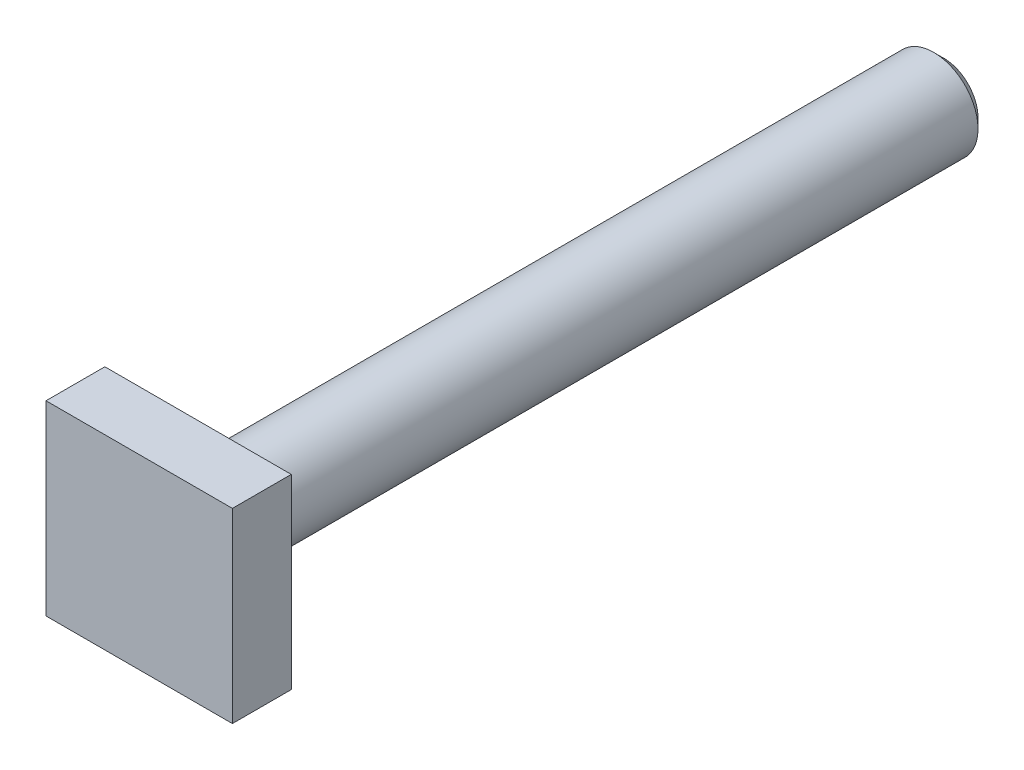
ISO-10303-21;
HEADER;
FILE_DESCRIPTION(('STEP AP214'),'2;1');
FILE_NAME('part.step','',(''),(''),'','','');
FILE_SCHEMA(('AUTOMOTIVE_DESIGN { 1 0 10303 214 1 1 1 1 }'));
ENDSEC;
DATA;
#1=APPLICATION_CONTEXT('core data for automotive mechanical design processes');
#2=APPLICATION_PROTOCOL_DEFINITION('international standard','automotive_design',2000,#1);
#3=PRODUCT_CONTEXT('',#1,'mechanical');
#4=PRODUCT('Part','Part','',(#3));
#5=PRODUCT_RELATED_PRODUCT_CATEGORY('part','',(#4));
#6=PRODUCT_DEFINITION_FORMATION('','',#4);
#7=PRODUCT_DEFINITION_CONTEXT('part definition',#1,'design');
#8=PRODUCT_DEFINITION('design','',#6,#7);
#9=PRODUCT_DEFINITION_SHAPE('','',#8);
#10=(LENGTH_UNIT() NAMED_UNIT(*) SI_UNIT(.MILLI.,.METRE.));
#11=(NAMED_UNIT(*) PLANE_ANGLE_UNIT() SI_UNIT($,.RADIAN.));
#12=(NAMED_UNIT(*) SI_UNIT($,.STERADIAN.) SOLID_ANGLE_UNIT());
#13=UNCERTAINTY_MEASURE_WITH_UNIT(LENGTH_MEASURE(1.E-05),#10,'distance_accuracy_value','');
#14=(GEOMETRIC_REPRESENTATION_CONTEXT(3) GLOBAL_UNCERTAINTY_ASSIGNED_CONTEXT((#13)) GLOBAL_UNIT_ASSIGNED_CONTEXT((#10,
#11,#12)) REPRESENTATION_CONTEXT('',''));
#15=CARTESIAN_POINT('',(0.,0.,0.));
#16=DIRECTION('',(0.,0.,1.));
#17=DIRECTION('',(1.,0.,0.));
#18=AXIS2_PLACEMENT_3D('',#15,#16,#17);
#19=CARTESIAN_POINT('',(0.,0.,-6.));
#20=DIRECTION('',(0.,0.,1.));
#21=DIRECTION('',(1.,0.,0.));
#22=AXIS2_PLACEMENT_3D('',#19,#20,#21);
#23=PLANE('',#22);
#24=DIRECTION('',(0.,1.,0.));
#25=VECTOR('',#24,1.);
#26=CARTESIAN_POINT('',(9.5,9.5,-6.));
#27=LINE('',#26,#25);
#28=CARTESIAN_POINT('',(9.5,-9.5,-6.));
#29=VERTEX_POINT('',#28);
#30=CARTESIAN_POINT('',(9.5,9.5,-6.));
#31=VERTEX_POINT('',#30);
#32=EDGE_CURVE('E107',#29,#31,#27,.T.);
#33=ORIENTED_EDGE('',*,*,#32,.F.);
#34=DIRECTION('',(1.,0.,0.));
#35=VECTOR('',#34,1.);
#36=CARTESIAN_POINT('',(-9.5,-9.5,-6.));
#37=LINE('',#36,#35);
#38=CARTESIAN_POINT('',(-9.5,-9.5,-6.));
#39=VERTEX_POINT('',#38);
#40=EDGE_CURVE('E104',#39,#29,#37,.T.);
#41=ORIENTED_EDGE('',*,*,#40,.F.);
#42=DIRECTION('',(0.,-1.,0.));
#43=VECTOR('',#42,1.);
#44=CARTESIAN_POINT('',(-9.5,9.5,-6.));
#45=LINE('',#44,#43);
#46=CARTESIAN_POINT('',(-9.5,9.5,-6.));
#47=VERTEX_POINT('',#46);
#48=EDGE_CURVE('E96',#47,#39,#45,.T.);
#49=ORIENTED_EDGE('',*,*,#48,.F.);
#50=DIRECTION('',(-1.,0.,0.));
#51=VECTOR('',#50,1.);
#52=CARTESIAN_POINT('',(-9.5,9.5,-6.));
#53=LINE('',#52,#51);
#54=EDGE_CURVE('E103',#31,#47,#53,.T.);
#55=ORIENTED_EDGE('',*,*,#54,.F.);
#56=EDGE_LOOP('',(#33,#41,#49,#55));
#57=FACE_BOUND('',#56,.T.);
#58=CARTESIAN_POINT('',(0.,0.,-6.00000000000001));
#59=DIRECTION('',(0.,0.,1.));
#60=DIRECTION('',(1.,0.,0.));
#61=AXIS2_PLACEMENT_3D('',#58,#59,#60);
#62=CIRCLE('',#61,4.5);
#63=CARTESIAN_POINT('',(4.5,0.,-6.00000000000001));
#64=VERTEX_POINT('',#63);
#65=EDGE_CURVE('E122',#64,#64,#62,.F.);
#66=ORIENTED_EDGE('',*,*,#65,.F.);
#67=EDGE_LOOP('',(#66));
#68=FACE_BOUND('',#67,.T.);
#69=ADVANCED_FACE('F45',(#57,#68),#23,.F.);
#70=CARTESIAN_POINT('',(9.5,9.5,-6.));
#71=DIRECTION('',(1.,0.,0.));
#72=DIRECTION('',(0.,1.,0.));
#73=AXIS2_PLACEMENT_3D('',#70,#71,#72);
#74=PLANE('',#73);
#75=DIRECTION('',(0.,1.,0.));
#76=VECTOR('',#75,1.);
#77=CARTESIAN_POINT('',(9.5,9.5,0.));
#78=LINE('',#77,#76);
#79=CARTESIAN_POINT('',(9.5,-9.5,0.));
#80=VERTEX_POINT('',#79);
#81=CARTESIAN_POINT('',(9.5,9.5,0.));
#82=VERTEX_POINT('',#81);
#83=EDGE_CURVE('E113',#80,#82,#78,.T.);
#84=ORIENTED_EDGE('',*,*,#83,.F.);
#85=DIRECTION('',(0.,0.,1.));
#86=VECTOR('',#85,1.);
#87=CARTESIAN_POINT('',(9.5,-9.5,-6.));
#88=LINE('',#87,#86);
#89=EDGE_CURVE('E62',#29,#80,#88,.T.);
#90=ORIENTED_EDGE('',*,*,#89,.F.);
#91=ORIENTED_EDGE('',*,*,#32,.T.);
#92=DIRECTION('',(0.,0.,1.));
#93=VECTOR('',#92,1.);
#94=CARTESIAN_POINT('',(9.5,9.5,-6.));
#95=LINE('',#94,#93);
#96=EDGE_CURVE('E90',#31,#82,#95,.T.);
#97=ORIENTED_EDGE('',*,*,#96,.T.);
#98=EDGE_LOOP('',(#84,#90,#91,#97));
#99=FACE_BOUND('',#98,.T.);
#100=ADVANCED_FACE('F140',(#99),#74,.T.);
#101=CARTESIAN_POINT('',(-9.5,-9.5,-6.));
#102=DIRECTION('',(0.,-1.,0.));
#103=DIRECTION('',(0.,0.,-1.));
#104=AXIS2_PLACEMENT_3D('',#101,#102,#103);
#105=PLANE('',#104);
#106=DIRECTION('',(1.,0.,0.));
#107=VECTOR('',#106,1.);
#108=CARTESIAN_POINT('',(-9.5,-9.5,0.));
#109=LINE('',#108,#107);
#110=CARTESIAN_POINT('',(-9.5,-9.5,0.));
#111=VERTEX_POINT('',#110);
#112=EDGE_CURVE('E109',#111,#80,#109,.T.);
#113=ORIENTED_EDGE('',*,*,#112,.F.);
#114=DIRECTION('',(0.,0.,1.));
#115=VECTOR('',#114,1.);
#116=CARTESIAN_POINT('',(-9.5,-9.5,-6.));
#117=LINE('',#116,#115);
#118=EDGE_CURVE('E79',#39,#111,#117,.T.);
#119=ORIENTED_EDGE('',*,*,#118,.F.);
#120=ORIENTED_EDGE('',*,*,#40,.T.);
#121=ORIENTED_EDGE('',*,*,#89,.T.);
#122=EDGE_LOOP('',(#113,#119,#120,#121));
#123=FACE_BOUND('',#122,.T.);
#124=ADVANCED_FACE('F145',(#123),#105,.T.);
#125=CARTESIAN_POINT('',(-9.5,9.5,-6.));
#126=DIRECTION('',(-1.,0.,0.));
#127=DIRECTION('',(0.,0.,1.));
#128=AXIS2_PLACEMENT_3D('',#125,#126,#127);
#129=PLANE('',#128);
#130=DIRECTION('',(0.,-1.,0.));
#131=VECTOR('',#130,1.);
#132=CARTESIAN_POINT('',(-9.5,9.5,0.));
#133=LINE('',#132,#131);
#134=CARTESIAN_POINT('',(-9.5,9.5,0.));
#135=VERTEX_POINT('',#134);
#136=EDGE_CURVE('E98',#135,#111,#133,.T.);
#137=ORIENTED_EDGE('',*,*,#136,.F.);
#138=DIRECTION('',(0.,0.,1.));
#139=VECTOR('',#138,1.);
#140=CARTESIAN_POINT('',(-9.5,9.5,-6.));
#141=LINE('',#140,#139);
#142=EDGE_CURVE('E93',#47,#135,#141,.T.);
#143=ORIENTED_EDGE('',*,*,#142,.F.);
#144=ORIENTED_EDGE('',*,*,#48,.T.);
#145=ORIENTED_EDGE('',*,*,#118,.T.);
#146=EDGE_LOOP('',(#137,#143,#144,#145));
#147=FACE_BOUND('',#146,.T.);
#148=ADVANCED_FACE('F95',(#147),#129,.T.);
#149=CARTESIAN_POINT('',(-9.5,9.5,-6.));
#150=DIRECTION('',(0.,1.,0.));
#151=DIRECTION('',(0.,0.,1.));
#152=AXIS2_PLACEMENT_3D('',#149,#150,#151);
#153=PLANE('',#152);
#154=DIRECTION('',(-1.,0.,0.));
#155=VECTOR('',#154,1.);
#156=CARTESIAN_POINT('',(-9.5,9.5,0.));
#157=LINE('',#156,#155);
#158=EDGE_CURVE('E116',#82,#135,#157,.T.);
#159=ORIENTED_EDGE('',*,*,#158,.F.);
#160=ORIENTED_EDGE('',*,*,#96,.F.);
#161=ORIENTED_EDGE('',*,*,#54,.T.);
#162=ORIENTED_EDGE('',*,*,#142,.T.);
#163=EDGE_LOOP('',(#159,#160,#161,#162));
#164=FACE_BOUND('',#163,.T.);
#165=ADVANCED_FACE('F106',(#164),#153,.T.);
#166=CARTESIAN_POINT('',(0.,0.,0.));
#167=DIRECTION('',(0.,0.,1.));
#168=DIRECTION('',(1.,0.,0.));
#169=AXIS2_PLACEMENT_3D('',#166,#167,#168);
#170=PLANE('',#169);
#171=ORIENTED_EDGE('',*,*,#83,.T.);
#172=ORIENTED_EDGE('',*,*,#158,.T.);
#173=ORIENTED_EDGE('',*,*,#136,.T.);
#174=ORIENTED_EDGE('',*,*,#112,.T.);
#175=EDGE_LOOP('',(#171,#172,#173,#174));
#176=FACE_BOUND('',#175,.T.);
#177=ADVANCED_FACE('F148',(#176),#170,.T.);
#178=CARTESIAN_POINT('',(0.,0.,-82.));
#179=DIRECTION('',(0.,0.,1.));
#180=DIRECTION('',(1.,0.,0.));
#181=AXIS2_PLACEMENT_3D('',#178,#179,#180);
#182=CYLINDRICAL_SURFACE('',#181,4.5);
#183=CARTESIAN_POINT('',(0.,0.,-81.));
#184=DIRECTION('',(0.,0.,-1.));
#185=DIRECTION('',(-1.,0.,0.));
#186=AXIS2_PLACEMENT_3D('',#183,#184,#185);
#187=CIRCLE('',#186,4.5);
#188=CARTESIAN_POINT('',(-4.5,0.,-81.));
#189=VERTEX_POINT('',#188);
#190=EDGE_CURVE('E13',#189,#189,#187,.F.);
#191=ORIENTED_EDGE('',*,*,#190,.T.);
#192=EDGE_LOOP('',(#191));
#193=FACE_BOUND('',#192,.T.);
#194=ORIENTED_EDGE('',*,*,#65,.T.);
#195=EDGE_LOOP('',(#194));
#196=FACE_BOUND('',#195,.T.);
#197=ADVANCED_FACE('F136',(#193,#196),#182,.T.);
#198=CARTESIAN_POINT('',(0.,0.,-82.));
#199=DIRECTION('',(0.,0.,-1.));
#200=DIRECTION('',(-1.,0.,0.));
#201=AXIS2_PLACEMENT_3D('',#198,#199,#200);
#202=PLANE('',#201);
#203=CARTESIAN_POINT('',(0.,0.,-82.));
#204=DIRECTION('',(0.,0.,-1.));
#205=DIRECTION('',(-1.,0.,0.));
#206=AXIS2_PLACEMENT_3D('',#203,#204,#205);
#207=CIRCLE('',#206,3.50000000000002);
#208=CARTESIAN_POINT('',(-3.50000000000002,0.,-82.));
#209=VERTEX_POINT('',#208);
#210=EDGE_CURVE('E54',#209,#209,#207,.T.);
#211=ORIENTED_EDGE('',*,*,#210,.T.);
#212=EDGE_LOOP('',(#211));
#213=FACE_BOUND('',#212,.T.);
#214=ADVANCED_FACE('F129',(#213),#202,.T.);
#215=CARTESIAN_POINT('',(0.,0.,-82.));
#216=DIRECTION('',(0.,0.,1.));
#217=DIRECTION('',(1.,0.,0.));
#218=AXIS2_PLACEMENT_3D('',#215,#216,#217);
#219=CONICAL_SURFACE('',#218,3.50000000000002,0.785398163397439);
#220=ORIENTED_EDGE('',*,*,#190,.F.);
#221=EDGE_LOOP('',(#220));
#222=FACE_BOUND('',#221,.T.);
#223=ORIENTED_EDGE('',*,*,#210,.F.);
#224=EDGE_LOOP('',(#223));
#225=FACE_BOUND('',#224,.T.);
#226=ADVANCED_FACE('F47',(#222,#225),#219,.T.);
#227=CLOSED_SHELL('',(#69,#100,#124,#148,#165,#177,#197,#214,#226));
#228=MANIFOLD_SOLID_BREP('B2',#227);
#229=ADVANCED_BREP_SHAPE_REPRESENTATION('',(#18,#228),#14);
#230=SHAPE_DEFINITION_REPRESENTATION(#9,#229);
ENDSEC;
END-ISO-10303-21;
